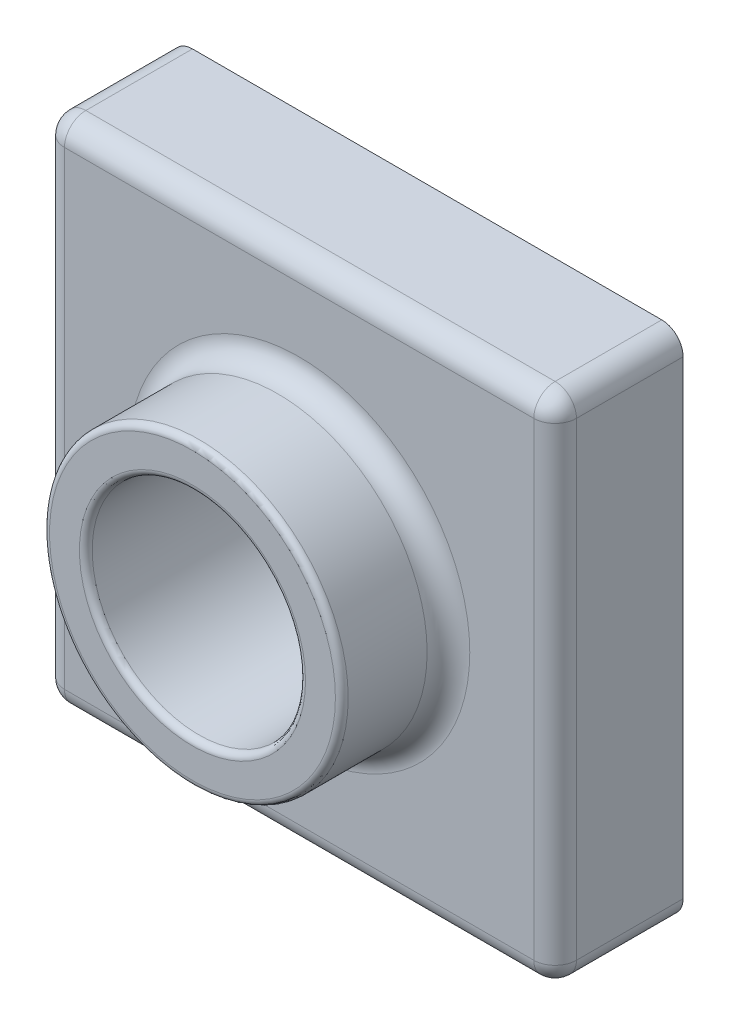
ISO-10303-21;
HEADER;
FILE_DESCRIPTION(('STEP AP214'),'2;1');
FILE_NAME('part.step','',(''),(''),'','','');
FILE_SCHEMA(('AUTOMOTIVE_DESIGN { 1 0 10303 214 1 1 1 1 }'));
ENDSEC;
DATA;
#1=APPLICATION_CONTEXT('core data for automotive mechanical design processes');
#2=APPLICATION_PROTOCOL_DEFINITION('international standard','automotive_design',2000,#1);
#3=PRODUCT_CONTEXT('',#1,'mechanical');
#4=PRODUCT('Part','Part','',(#3));
#5=PRODUCT_RELATED_PRODUCT_CATEGORY('part','',(#4));
#6=PRODUCT_DEFINITION_FORMATION('','',#4);
#7=PRODUCT_DEFINITION_CONTEXT('part definition',#1,'design');
#8=PRODUCT_DEFINITION('design','',#6,#7);
#9=PRODUCT_DEFINITION_SHAPE('','',#8);
#10=(LENGTH_UNIT() NAMED_UNIT(*) SI_UNIT(.MILLI.,.METRE.));
#11=(NAMED_UNIT(*) PLANE_ANGLE_UNIT() SI_UNIT($,.RADIAN.));
#12=(NAMED_UNIT(*) SI_UNIT($,.STERADIAN.) SOLID_ANGLE_UNIT());
#13=UNCERTAINTY_MEASURE_WITH_UNIT(LENGTH_MEASURE(1.E-05),#10,'distance_accuracy_value','');
#14=(GEOMETRIC_REPRESENTATION_CONTEXT(3) GLOBAL_UNCERTAINTY_ASSIGNED_CONTEXT((#13)) GLOBAL_UNIT_ASSIGNED_CONTEXT((#10,
#11,#12)) REPRESENTATION_CONTEXT('',''));
#15=CARTESIAN_POINT('',(0.,0.,0.));
#16=DIRECTION('',(0.,0.,1.));
#17=DIRECTION('',(1.,0.,0.));
#18=AXIS2_PLACEMENT_3D('',#15,#16,#17);
#19=CARTESIAN_POINT('',(0.,0.,0.));
#20=DIRECTION('',(0.,0.,1.));
#21=DIRECTION('',(1.,0.,0.));
#22=AXIS2_PLACEMENT_3D('',#19,#20,#21);
#23=PLANE('',#22);
#24=DIRECTION('',(-1.,0.,0.));
#25=VECTOR('',#24,1.);
#26=CARTESIAN_POINT('',(0.,120.,0.));
#27=LINE('',#26,#25);
#28=CARTESIAN_POINT('',(115.,120.,0.));
#29=VERTEX_POINT('',#28);
#30=CARTESIAN_POINT('',(5.,120.,0.));
#31=VERTEX_POINT('',#30);
#32=EDGE_CURVE('E299',#29,#31,#27,.T.);
#33=ORIENTED_EDGE('',*,*,#32,.F.);
#34=CARTESIAN_POINT('',(115.,115.,0.));
#35=DIRECTION('',(0.,0.,1.));
#36=DIRECTION('',(1.,0.,0.));
#37=AXIS2_PLACEMENT_3D('',#34,#35,#36);
#38=CIRCLE('',#37,5.);
#39=CARTESIAN_POINT('',(120.,115.,0.));
#40=VERTEX_POINT('',#39);
#41=EDGE_CURVE('E369',#29,#40,#38,.F.);
#42=ORIENTED_EDGE('',*,*,#41,.T.);
#43=DIRECTION('',(0.,1.,0.));
#44=VECTOR('',#43,1.);
#45=CARTESIAN_POINT('',(120.,120.,0.));
#46=LINE('',#45,#44);
#47=CARTESIAN_POINT('',(120.,5.,0.));
#48=VERTEX_POINT('',#47);
#49=EDGE_CURVE('E295',#48,#40,#46,.T.);
#50=ORIENTED_EDGE('',*,*,#49,.F.);
#51=CARTESIAN_POINT('',(115.,5.,0.));
#52=DIRECTION('',(0.,0.,1.));
#53=DIRECTION('',(1.,0.,0.));
#54=AXIS2_PLACEMENT_3D('',#51,#52,#53);
#55=CIRCLE('',#54,5.);
#56=CARTESIAN_POINT('',(115.,0.,0.));
#57=VERTEX_POINT('',#56);
#58=EDGE_CURVE('E360',#48,#57,#55,.F.);
#59=ORIENTED_EDGE('',*,*,#58,.T.);
#60=DIRECTION('',(1.,0.,0.));
#61=VECTOR('',#60,1.);
#62=CARTESIAN_POINT('',(0.,0.,0.));
#63=LINE('',#62,#61);
#64=CARTESIAN_POINT('',(5.,0.,0.));
#65=VERTEX_POINT('',#64);
#66=EDGE_CURVE('E291',#65,#57,#63,.T.);
#67=ORIENTED_EDGE('',*,*,#66,.F.);
#68=CARTESIAN_POINT('',(5.,5.,0.));
#69=DIRECTION('',(0.,0.,1.));
#70=DIRECTION('',(1.,0.,0.));
#71=AXIS2_PLACEMENT_3D('',#68,#69,#70);
#72=CIRCLE('',#71,5.);
#73=CARTESIAN_POINT('',(0.,5.,0.));
#74=VERTEX_POINT('',#73);
#75=EDGE_CURVE('E363',#65,#74,#72,.F.);
#76=ORIENTED_EDGE('',*,*,#75,.T.);
#77=DIRECTION('',(0.,-1.,0.));
#78=VECTOR('',#77,1.);
#79=CARTESIAN_POINT('',(0.,120.,0.));
#80=LINE('',#79,#78);
#81=CARTESIAN_POINT('',(0.,115.,0.));
#82=VERTEX_POINT('',#81);
#83=EDGE_CURVE('E286',#82,#74,#80,.T.);
#84=ORIENTED_EDGE('',*,*,#83,.F.);
#85=CARTESIAN_POINT('',(5.,115.,0.));
#86=DIRECTION('',(0.,0.,1.));
#87=DIRECTION('',(1.,0.,0.));
#88=AXIS2_PLACEMENT_3D('',#85,#86,#87);
#89=CIRCLE('',#88,5.);
#90=EDGE_CURVE('E366',#82,#31,#89,.F.);
#91=ORIENTED_EDGE('',*,*,#90,.T.);
#92=EDGE_LOOP('',(#33,#42,#50,#59,#67,#76,#84,#91));
#93=FACE_BOUND('',#92,.T.);
#94=CARTESIAN_POINT('',(115.,115.,0.));
#95=DIRECTION('',(0.,0.,1.));
#96=DIRECTION('',(1.,0.,0.));
#97=AXIS2_PLACEMENT_3D('',#94,#95,#96);
#98=CIRCLE('',#97,3.);
#99=CARTESIAN_POINT('',(115.,118.,0.));
#100=VERTEX_POINT('',#99);
#101=CARTESIAN_POINT('',(118.,115.,0.));
#102=VERTEX_POINT('',#101);
#103=EDGE_CURVE('E247',#100,#102,#98,.F.);
#104=ORIENTED_EDGE('',*,*,#103,.F.);
#105=DIRECTION('',(-1.,0.,0.));
#106=VECTOR('',#105,1.);
#107=CARTESIAN_POINT('',(0.,118.,0.));
#108=LINE('',#107,#106);
#109=CARTESIAN_POINT('',(5.,118.,0.));
#110=VERTEX_POINT('',#109);
#111=EDGE_CURVE('E260',#100,#110,#108,.T.);
#112=ORIENTED_EDGE('',*,*,#111,.T.);
#113=CARTESIAN_POINT('',(5.,115.,0.));
#114=DIRECTION('',(0.,0.,1.));
#115=DIRECTION('',(1.,0.,0.));
#116=AXIS2_PLACEMENT_3D('',#113,#114,#115);
#117=CIRCLE('',#116,3.);
#118=CARTESIAN_POINT('',(2.,115.,0.));
#119=VERTEX_POINT('',#118);
#120=EDGE_CURVE('E256',#119,#110,#117,.F.);
#121=ORIENTED_EDGE('',*,*,#120,.F.);
#122=DIRECTION('',(0.,-1.,0.));
#123=VECTOR('',#122,1.);
#124=CARTESIAN_POINT('',(2.,120.,0.));
#125=LINE('',#124,#123);
#126=CARTESIAN_POINT('',(2.,5.,0.));
#127=VERTEX_POINT('',#126);
#128=EDGE_CURVE('E55',#119,#127,#125,.T.);
#129=ORIENTED_EDGE('',*,*,#128,.T.);
#130=CARTESIAN_POINT('',(5.,5.,0.));
#131=DIRECTION('',(0.,0.,1.));
#132=DIRECTION('',(1.,0.,0.));
#133=AXIS2_PLACEMENT_3D('',#130,#131,#132);
#134=CIRCLE('',#133,3.);
#135=CARTESIAN_POINT('',(5.,2.,0.));
#136=VERTEX_POINT('',#135);
#137=EDGE_CURVE('E259',#136,#127,#134,.F.);
#138=ORIENTED_EDGE('',*,*,#137,.F.);
#139=DIRECTION('',(1.,0.,0.));
#140=VECTOR('',#139,1.);
#141=CARTESIAN_POINT('',(0.,2.,0.));
#142=LINE('',#141,#140);
#143=CARTESIAN_POINT('',(115.,2.,0.));
#144=VERTEX_POINT('',#143);
#145=EDGE_CURVE('E254',#136,#144,#142,.T.);
#146=ORIENTED_EDGE('',*,*,#145,.T.);
#147=CARTESIAN_POINT('',(115.,5.,0.));
#148=DIRECTION('',(0.,0.,1.));
#149=DIRECTION('',(1.,0.,0.));
#150=AXIS2_PLACEMENT_3D('',#147,#148,#149);
#151=CIRCLE('',#150,3.);
#152=CARTESIAN_POINT('',(118.,5.,0.));
#153=VERTEX_POINT('',#152);
#154=EDGE_CURVE('E241',#153,#144,#151,.F.);
#155=ORIENTED_EDGE('',*,*,#154,.F.);
#156=DIRECTION('',(0.,1.,0.));
#157=VECTOR('',#156,1.);
#158=CARTESIAN_POINT('',(118.,120.,0.));
#159=LINE('',#158,#157);
#160=EDGE_CURVE('E265',#153,#102,#159,.T.);
#161=ORIENTED_EDGE('',*,*,#160,.T.);
#162=EDGE_LOOP('',(#104,#112,#121,#129,#138,#146,#155,#161));
#163=FACE_BOUND('',#162,.T.);
#164=ADVANCED_FACE('F39',(#93,#163),#23,.F.);
#165=CARTESIAN_POINT('',(0.,120.,30.));
#166=DIRECTION('',(1.,0.,0.));
#167=DIRECTION('',(0.,0.,-1.));
#168=AXIS2_PLACEMENT_3D('',#165,#166,#167);
#169=PLANE('',#168);
#170=DIRECTION('',(0.,-1.,0.));
#171=VECTOR('',#170,1.);
#172=CARTESIAN_POINT('',(0.,120.,25.));
#173=LINE('',#172,#171);
#174=CARTESIAN_POINT('',(0.,5.,25.));
#175=VERTEX_POINT('',#174);
#176=CARTESIAN_POINT('',(0.,115.,25.));
#177=VERTEX_POINT('',#176);
#178=EDGE_CURVE('E63',#175,#177,#173,.F.);
#179=ORIENTED_EDGE('',*,*,#178,.T.);
#180=DIRECTION('',(0.,0.,-1.));
#181=VECTOR('',#180,1.);
#182=CARTESIAN_POINT('',(0.,115.,30.));
#183=LINE('',#182,#181);
#184=EDGE_CURVE('E353',#177,#82,#183,.T.);
#185=ORIENTED_EDGE('',*,*,#184,.T.);
#186=ORIENTED_EDGE('',*,*,#83,.T.);
#187=DIRECTION('',(0.,0.,-1.));
#188=VECTOR('',#187,1.);
#189=CARTESIAN_POINT('',(0.,5.,30.));
#190=LINE('',#189,#188);
#191=EDGE_CURVE('E348',#74,#175,#190,.F.);
#192=ORIENTED_EDGE('',*,*,#191,.T.);
#193=EDGE_LOOP('',(#179,#185,#186,#192));
#194=FACE_BOUND('',#193,.T.);
#195=ADVANCED_FACE('F469',(#194),#169,.F.);
#196=CARTESIAN_POINT('',(0.,0.,30.));
#197=DIRECTION('',(0.,1.,0.));
#198=DIRECTION('',(0.,0.,1.));
#199=AXIS2_PLACEMENT_3D('',#196,#197,#198);
#200=PLANE('',#199);
#201=DIRECTION('',(1.,0.,0.));
#202=VECTOR('',#201,1.);
#203=CARTESIAN_POINT('',(0.,0.,25.));
#204=LINE('',#203,#202);
#205=CARTESIAN_POINT('',(115.,0.,25.));
#206=VERTEX_POINT('',#205);
#207=CARTESIAN_POINT('',(5.,0.,25.));
#208=VERTEX_POINT('',#207);
#209=EDGE_CURVE('E342',#206,#208,#204,.F.);
#210=ORIENTED_EDGE('',*,*,#209,.T.);
#211=DIRECTION('',(0.,0.,-1.));
#212=VECTOR('',#211,1.);
#213=CARTESIAN_POINT('',(5.,0.,30.));
#214=LINE('',#213,#212);
#215=EDGE_CURVE('E345',#208,#65,#214,.T.);
#216=ORIENTED_EDGE('',*,*,#215,.T.);
#217=ORIENTED_EDGE('',*,*,#66,.T.);
#218=DIRECTION('',(0.,0.,-1.));
#219=VECTOR('',#218,1.);
#220=CARTESIAN_POINT('',(115.,0.,30.));
#221=LINE('',#220,#219);
#222=EDGE_CURVE('E339',#57,#206,#221,.F.);
#223=ORIENTED_EDGE('',*,*,#222,.T.);
#224=EDGE_LOOP('',(#210,#216,#217,#223));
#225=FACE_BOUND('',#224,.T.);
#226=ADVANCED_FACE('F474',(#225),#200,.F.);
#227=CARTESIAN_POINT('',(120.,120.,30.));
#228=DIRECTION('',(-1.,0.,0.));
#229=DIRECTION('',(0.,0.,1.));
#230=AXIS2_PLACEMENT_3D('',#227,#228,#229);
#231=PLANE('',#230);
#232=ORIENTED_EDGE('',*,*,#49,.T.);
#233=DIRECTION('',(0.,0.,-1.));
#234=VECTOR('',#233,1.);
#235=CARTESIAN_POINT('',(120.,115.,30.));
#236=LINE('',#235,#234);
#237=CARTESIAN_POINT('',(120.,115.,25.));
#238=VERTEX_POINT('',#237);
#239=EDGE_CURVE('E336',#40,#238,#236,.F.);
#240=ORIENTED_EDGE('',*,*,#239,.T.);
#241=DIRECTION('',(0.,1.,0.));
#242=VECTOR('',#241,1.);
#243=CARTESIAN_POINT('',(120.,0.,25.));
#244=LINE('',#243,#242);
#245=CARTESIAN_POINT('',(120.,5.,25.));
#246=VERTEX_POINT('',#245);
#247=EDGE_CURVE('E333',#238,#246,#244,.F.);
#248=ORIENTED_EDGE('',*,*,#247,.T.);
#249=DIRECTION('',(0.,0.,-1.));
#250=VECTOR('',#249,1.);
#251=CARTESIAN_POINT('',(120.,5.,30.));
#252=LINE('',#251,#250);
#253=EDGE_CURVE('E330',#246,#48,#252,.T.);
#254=ORIENTED_EDGE('',*,*,#253,.T.);
#255=EDGE_LOOP('',(#232,#240,#248,#254));
#256=FACE_BOUND('',#255,.T.);
#257=ADVANCED_FACE('F904',(#256),#231,.F.);
#258=CARTESIAN_POINT('',(0.,120.,30.));
#259=DIRECTION('',(0.,-1.,0.));
#260=DIRECTION('',(0.,0.,-1.));
#261=AXIS2_PLACEMENT_3D('',#258,#259,#260);
#262=PLANE('',#261);
#263=DIRECTION('',(-1.,0.,0.));
#264=VECTOR('',#263,1.);
#265=CARTESIAN_POINT('',(120.,120.,25.));
#266=LINE('',#265,#264);
#267=CARTESIAN_POINT('',(5.,120.,25.));
#268=VERTEX_POINT('',#267);
#269=CARTESIAN_POINT('',(115.,120.,25.));
#270=VERTEX_POINT('',#269);
#271=EDGE_CURVE('E323',#268,#270,#266,.F.);
#272=ORIENTED_EDGE('',*,*,#271,.T.);
#273=DIRECTION('',(0.,0.,-1.));
#274=VECTOR('',#273,1.);
#275=CARTESIAN_POINT('',(115.,120.,30.));
#276=LINE('',#275,#274);
#277=EDGE_CURVE('E327',#270,#29,#276,.T.);
#278=ORIENTED_EDGE('',*,*,#277,.T.);
#279=ORIENTED_EDGE('',*,*,#32,.T.);
#280=DIRECTION('',(0.,0.,-1.));
#281=VECTOR('',#280,1.);
#282=CARTESIAN_POINT('',(5.,120.,30.));
#283=LINE('',#282,#281);
#284=EDGE_CURVE('E320',#31,#268,#283,.F.);
#285=ORIENTED_EDGE('',*,*,#284,.T.);
#286=EDGE_LOOP('',(#272,#278,#279,#285));
#287=FACE_BOUND('',#286,.T.);
#288=ADVANCED_FACE('F463',(#287),#262,.F.);
#289=CARTESIAN_POINT('',(0.,0.,30.));
#290=DIRECTION('',(0.,0.,1.));
#291=DIRECTION('',(1.,0.,0.));
#292=AXIS2_PLACEMENT_3D('',#289,#290,#291);
#293=PLANE('',#292);
#294=DIRECTION('',(0.,1.,0.));
#295=VECTOR('',#294,1.);
#296=CARTESIAN_POINT('',(115.,120.,30.));
#297=LINE('',#296,#295);
#298=CARTESIAN_POINT('',(115.,5.,30.));
#299=VERTEX_POINT('',#298);
#300=CARTESIAN_POINT('',(115.,115.,30.));
#301=VERTEX_POINT('',#300);
#302=EDGE_CURVE('E313',#299,#301,#297,.T.);
#303=ORIENTED_EDGE('',*,*,#302,.T.);
#304=DIRECTION('',(-1.,0.,0.));
#305=VECTOR('',#304,1.);
#306=CARTESIAN_POINT('',(0.,115.,30.));
#307=LINE('',#306,#305);
#308=CARTESIAN_POINT('',(5.,115.,30.));
#309=VERTEX_POINT('',#308);
#310=EDGE_CURVE('E316',#301,#309,#307,.T.);
#311=ORIENTED_EDGE('',*,*,#310,.T.);
#312=DIRECTION('',(0.,-1.,0.));
#313=VECTOR('',#312,1.);
#314=CARTESIAN_POINT('',(5.,0.,30.));
#315=LINE('',#314,#313);
#316=CARTESIAN_POINT('',(5.,5.,30.));
#317=VERTEX_POINT('',#316);
#318=EDGE_CURVE('E307',#309,#317,#315,.T.);
#319=ORIENTED_EDGE('',*,*,#318,.T.);
#320=DIRECTION('',(1.,0.,0.));
#321=VECTOR('',#320,1.);
#322=CARTESIAN_POINT('',(120.,5.,30.));
#323=LINE('',#322,#321);
#324=EDGE_CURVE('E310',#317,#299,#323,.T.);
#325=ORIENTED_EDGE('',*,*,#324,.T.);
#326=EDGE_LOOP('',(#303,#311,#319,#325));
#327=FACE_BOUND('',#326,.T.);
#328=CARTESIAN_POINT('',(60.,60.,30.));
#329=DIRECTION('',(0.,0.,1.));
#330=DIRECTION('',(1.,0.,0.));
#331=AXIS2_PLACEMENT_3D('',#328,#329,#330);
#332=CIRCLE('',#331,40.);
#333=CARTESIAN_POINT('',(100.,60.,30.));
#334=VERTEX_POINT('',#333);
#335=EDGE_CURVE('E303',#334,#334,#332,.F.);
#336=ORIENTED_EDGE('',*,*,#335,.T.);
#337=EDGE_LOOP('',(#336));
#338=FACE_BOUND('',#337,.T.);
#339=ADVANCED_FACE('F455',(#327,#338),#293,.T.);
#340=CARTESIAN_POINT('',(60.,60.,0.));
#341=DIRECTION('',(0.,0.,1.));
#342=DIRECTION('',(1.,0.,0.));
#343=AXIS2_PLACEMENT_3D('',#340,#341,#342);
#344=CIRCLE('',#343,27.);
#345=CARTESIAN_POINT('',(87.,60.,0.));
#346=VERTEX_POINT('',#345);
#347=EDGE_CURVE('E255',#346,#346,#344,.T.);
#348=ORIENTED_EDGE('',*,*,#347,.F.);
#349=EDGE_LOOP('',(#348));
#350=FACE_BOUND('',#349,.T.);
#351=CARTESIAN_POINT('',(60.,60.,0.));
#352=DIRECTION('',(0.,0.,1.));
#353=DIRECTION('',(1.,0.,0.));
#354=AXIS2_PLACEMENT_3D('',#351,#352,#353);
#355=CIRCLE('',#354,25.);
#356=CARTESIAN_POINT('',(85.,60.,0.));
#357=VERTEX_POINT('',#356);
#358=EDGE_CURVE('E282',#357,#357,#355,.T.);
#359=ORIENTED_EDGE('',*,*,#358,.T.);
#360=EDGE_LOOP('',(#359));
#361=FACE_BOUND('',#360,.T.);
#362=ADVANCED_FACE('F453',(#350,#361),#23,.F.);
#363=CARTESIAN_POINT('',(60.,60.,55.));
#364=DIRECTION('',(0.,0.,-1.));
#365=DIRECTION('',(-1.,0.,0.));
#366=AXIS2_PLACEMENT_3D('',#363,#364,#365);
#367=CYLINDRICAL_SURFACE('',#366,35.);
#368=CARTESIAN_POINT('',(60.,60.,53.5));
#369=DIRECTION('',(0.,0.,1.));
#370=DIRECTION('',(1.,0.,0.));
#371=AXIS2_PLACEMENT_3D('',#368,#369,#370);
#372=CIRCLE('',#371,35.);
#373=CARTESIAN_POINT('',(95.,60.,53.5));
#374=VERTEX_POINT('',#373);
#375=EDGE_CURVE('E48',#374,#374,#372,.F.);
#376=ORIENTED_EDGE('',*,*,#375,.T.);
#377=EDGE_LOOP('',(#376));
#378=FACE_BOUND('',#377,.T.);
#379=CARTESIAN_POINT('',(60.,60.,35.));
#380=DIRECTION('',(0.,0.,1.));
#381=DIRECTION('',(1.,0.,0.));
#382=AXIS2_PLACEMENT_3D('',#379,#380,#381);
#383=CIRCLE('',#382,35.);
#384=CARTESIAN_POINT('',(95.,60.,35.));
#385=VERTEX_POINT('',#384);
#386=EDGE_CURVE('E356',#385,#385,#383,.T.);
#387=ORIENTED_EDGE('',*,*,#386,.T.);
#388=EDGE_LOOP('',(#387));
#389=FACE_BOUND('',#388,.T.);
#390=ADVANCED_FACE('F427',(#378,#389),#367,.T.);
#391=CARTESIAN_POINT('',(60.,60.,55.));
#392=DIRECTION('',(0.,0.,1.));
#393=DIRECTION('',(1.,0.,0.));
#394=AXIS2_PLACEMENT_3D('',#391,#392,#393);
#395=PLANE('',#394);
#396=CARTESIAN_POINT('',(60.,60.,55.));
#397=DIRECTION('',(0.,0.,1.));
#398=DIRECTION('',(1.,0.,0.));
#399=AXIS2_PLACEMENT_3D('',#396,#397,#398);
#400=CIRCLE('',#399,33.5);
#401=CARTESIAN_POINT('',(93.5,60.,55.));
#402=VERTEX_POINT('',#401);
#403=EDGE_CURVE('E420',#402,#402,#400,.T.);
#404=ORIENTED_EDGE('',*,*,#403,.T.);
#405=EDGE_LOOP('',(#404));
#406=FACE_BOUND('',#405,.T.);
#407=CARTESIAN_POINT('',(60.,60.,55.));
#408=DIRECTION('',(0.,0.,1.));
#409=DIRECTION('',(1.,0.,0.));
#410=AXIS2_PLACEMENT_3D('',#407,#408,#409);
#411=CIRCLE('',#410,26.5);
#412=CARTESIAN_POINT('',(86.5,60.,55.));
#413=VERTEX_POINT('',#412);
#414=EDGE_CURVE('E372',#413,#413,#411,.F.);
#415=ORIENTED_EDGE('',*,*,#414,.T.);
#416=EDGE_LOOP('',(#415));
#417=FACE_BOUND('',#416,.T.);
#418=ADVANCED_FACE('F436',(#406,#417),#395,.T.);
#419=CARTESIAN_POINT('',(60.,60.,0.));
#420=DIRECTION('',(0.,0.,1.));
#421=DIRECTION('',(1.,0.,0.));
#422=AXIS2_PLACEMENT_3D('',#419,#420,#421);
#423=CYLINDRICAL_SURFACE('',#422,25.);
#424=CARTESIAN_POINT('',(60.,60.,53.5));
#425=DIRECTION('',(0.,0.,1.));
#426=DIRECTION('',(1.,0.,0.));
#427=AXIS2_PLACEMENT_3D('',#424,#425,#426);
#428=CIRCLE('',#427,25.);
#429=CARTESIAN_POINT('',(85.,60.,53.5));
#430=VERTEX_POINT('',#429);
#431=EDGE_CURVE('E11',#430,#430,#428,.T.);
#432=ORIENTED_EDGE('',*,*,#431,.T.);
#433=EDGE_LOOP('',(#432));
#434=FACE_BOUND('',#433,.T.);
#435=ORIENTED_EDGE('',*,*,#358,.F.);
#436=EDGE_LOOP('',(#435));
#437=FACE_BOUND('',#436,.T.);
#438=ADVANCED_FACE('F439',(#434,#437),#423,.F.);
#439=CARTESIAN_POINT('',(115.,5.,30.));
#440=DIRECTION('',(0.,0.,-1.));
#441=DIRECTION('',(-1.,0.,0.));
#442=AXIS2_PLACEMENT_3D('',#439,#440,#441);
#443=CYLINDRICAL_SURFACE('',#442,5.);
#444=ORIENTED_EDGE('',*,*,#58,.F.);
#445=ORIENTED_EDGE('',*,*,#253,.F.);
#446=CARTESIAN_POINT('',(115.,5.,25.));
#447=DIRECTION('',(0.,0.,1.));
#448=DIRECTION('',(1.,0.,0.));
#449=AXIS2_PLACEMENT_3D('',#446,#447,#448);
#450=CIRCLE('',#449,5.);
#451=EDGE_CURVE('E287',#206,#246,#450,.T.);
#452=ORIENTED_EDGE('',*,*,#451,.F.);
#453=ORIENTED_EDGE('',*,*,#222,.F.);
#454=EDGE_LOOP('',(#444,#445,#452,#453));
#455=FACE_BOUND('',#454,.T.);
#456=ADVANCED_FACE('F449',(#455),#443,.T.);
#457=CARTESIAN_POINT('',(0.,5.,25.));
#458=DIRECTION('',(-1.,0.,0.));
#459=DIRECTION('',(0.,0.,1.));
#460=AXIS2_PLACEMENT_3D('',#457,#458,#459);
#461=CYLINDRICAL_SURFACE('',#460,5.);
#462=CARTESIAN_POINT('',(5.,5.,25.));
#463=DIRECTION('',(-1.,0.,0.));
#464=DIRECTION('',(0.,0.,1.));
#465=AXIS2_PLACEMENT_3D('',#462,#463,#464);
#466=CIRCLE('',#465,5.);
#467=EDGE_CURVE('E406',#208,#317,#466,.T.);
#468=ORIENTED_EDGE('',*,*,#467,.F.);
#469=ORIENTED_EDGE('',*,*,#209,.F.);
#470=CARTESIAN_POINT('',(115.,5.,25.));
#471=DIRECTION('',(1.,0.,0.));
#472=DIRECTION('',(0.,0.,-1.));
#473=AXIS2_PLACEMENT_3D('',#470,#471,#472);
#474=CIRCLE('',#473,5.);
#475=EDGE_CURVE('E410',#299,#206,#474,.T.);
#476=ORIENTED_EDGE('',*,*,#475,.F.);
#477=ORIENTED_EDGE('',*,*,#324,.F.);
#478=EDGE_LOOP('',(#468,#469,#476,#477));
#479=FACE_BOUND('',#478,.T.);
#480=ADVANCED_FACE('F873',(#479),#461,.T.);
#481=CARTESIAN_POINT('',(5.,5.,30.));
#482=DIRECTION('',(0.,0.,-1.));
#483=DIRECTION('',(-1.,0.,0.));
#484=AXIS2_PLACEMENT_3D('',#481,#482,#483);
#485=CYLINDRICAL_SURFACE('',#484,5.);
#486=ORIENTED_EDGE('',*,*,#75,.F.);
#487=ORIENTED_EDGE('',*,*,#215,.F.);
#488=CARTESIAN_POINT('',(5.,5.,25.));
#489=DIRECTION('',(0.,0.,1.));
#490=DIRECTION('',(1.,0.,0.));
#491=AXIS2_PLACEMENT_3D('',#488,#489,#490);
#492=CIRCLE('',#491,5.);
#493=EDGE_CURVE('E402',#175,#208,#492,.T.);
#494=ORIENTED_EDGE('',*,*,#493,.F.);
#495=ORIENTED_EDGE('',*,*,#191,.F.);
#496=EDGE_LOOP('',(#486,#487,#494,#495));
#497=FACE_BOUND('',#496,.T.);
#498=ADVANCED_FACE('F863',(#497),#485,.T.);
#499=CARTESIAN_POINT('',(115.,5.,25.));
#500=DIRECTION('',(0.,0.,1.));
#501=DIRECTION('',(1.,0.,0.));
#502=AXIS2_PLACEMENT_3D('',#499,#500,#501);
#503=SPHERICAL_SURFACE('',#502,5.);
#504=ORIENTED_EDGE('',*,*,#475,.T.);
#505=ORIENTED_EDGE('',*,*,#451,.T.);
#506=CARTESIAN_POINT('',(115.,5.,25.));
#507=DIRECTION('',(0.,-1.,0.));
#508=DIRECTION('',(0.,0.,-1.));
#509=AXIS2_PLACEMENT_3D('',#506,#507,#508);
#510=CIRCLE('',#509,5.);
#511=EDGE_CURVE('E398',#299,#246,#510,.F.);
#512=ORIENTED_EDGE('',*,*,#511,.F.);
#513=EDGE_LOOP('',(#504,#505,#512));
#514=FACE_BOUND('',#513,.T.);
#515=ADVANCED_FACE('F853',(#514),#503,.T.);
#516=CARTESIAN_POINT('',(5.,5.,25.));
#517=DIRECTION('',(0.,0.,1.));
#518=DIRECTION('',(1.,0.,0.));
#519=AXIS2_PLACEMENT_3D('',#516,#517,#518);
#520=SPHERICAL_SURFACE('',#519,5.);
#521=ORIENTED_EDGE('',*,*,#493,.T.);
#522=ORIENTED_EDGE('',*,*,#467,.T.);
#523=CARTESIAN_POINT('',(5.,5.,25.));
#524=DIRECTION('',(0.,-1.,0.));
#525=DIRECTION('',(0.,0.,-1.));
#526=AXIS2_PLACEMENT_3D('',#523,#524,#525);
#527=CIRCLE('',#526,5.);
#528=EDGE_CURVE('E394',#175,#317,#527,.F.);
#529=ORIENTED_EDGE('',*,*,#528,.F.);
#530=EDGE_LOOP('',(#521,#522,#529));
#531=FACE_BOUND('',#530,.T.);
#532=ADVANCED_FACE('F843',(#531),#520,.T.);
#533=CARTESIAN_POINT('',(115.,115.,30.));
#534=DIRECTION('',(0.,0.,-1.));
#535=DIRECTION('',(-1.,0.,0.));
#536=AXIS2_PLACEMENT_3D('',#533,#534,#535);
#537=CYLINDRICAL_SURFACE('',#536,5.);
#538=ORIENTED_EDGE('',*,*,#41,.F.);
#539=ORIENTED_EDGE('',*,*,#277,.F.);
#540=CARTESIAN_POINT('',(115.,115.,25.));
#541=DIRECTION('',(0.,0.,1.));
#542=DIRECTION('',(1.,0.,0.));
#543=AXIS2_PLACEMENT_3D('',#540,#541,#542);
#544=CIRCLE('',#543,5.);
#545=EDGE_CURVE('E390',#238,#270,#544,.T.);
#546=ORIENTED_EDGE('',*,*,#545,.F.);
#547=ORIENTED_EDGE('',*,*,#239,.F.);
#548=EDGE_LOOP('',(#538,#539,#546,#547));
#549=FACE_BOUND('',#548,.T.);
#550=ADVANCED_FACE('F833',(#549),#537,.T.);
#551=CARTESIAN_POINT('',(115.,0.,25.));
#552=DIRECTION('',(0.,-1.,0.));
#553=DIRECTION('',(0.,0.,-1.));
#554=AXIS2_PLACEMENT_3D('',#551,#552,#553);
#555=CYLINDRICAL_SURFACE('',#554,5.);
#556=ORIENTED_EDGE('',*,*,#511,.T.);
#557=ORIENTED_EDGE('',*,*,#247,.F.);
#558=CARTESIAN_POINT('',(115.,115.,25.));
#559=DIRECTION('',(0.,1.,0.));
#560=DIRECTION('',(0.,0.,1.));
#561=AXIS2_PLACEMENT_3D('',#558,#559,#560);
#562=CIRCLE('',#561,5.);
#563=EDGE_CURVE('E386',#301,#238,#562,.T.);
#564=ORIENTED_EDGE('',*,*,#563,.F.);
#565=ORIENTED_EDGE('',*,*,#302,.F.);
#566=EDGE_LOOP('',(#556,#557,#564,#565));
#567=FACE_BOUND('',#566,.T.);
#568=ADVANCED_FACE('F823',(#567),#555,.T.);
#569=CARTESIAN_POINT('',(5.,0.,25.));
#570=DIRECTION('',(0.,1.,0.));
#571=DIRECTION('',(0.,0.,1.));
#572=AXIS2_PLACEMENT_3D('',#569,#570,#571);
#573=CYLINDRICAL_SURFACE('',#572,5.);
#574=ORIENTED_EDGE('',*,*,#528,.T.);
#575=ORIENTED_EDGE('',*,*,#318,.F.);
#576=CARTESIAN_POINT('',(5.,115.,25.));
#577=DIRECTION('',(0.,1.,0.));
#578=DIRECTION('',(0.,0.,1.));
#579=AXIS2_PLACEMENT_3D('',#576,#577,#578);
#580=CIRCLE('',#579,5.);
#581=EDGE_CURVE('E382',#177,#309,#580,.T.);
#582=ORIENTED_EDGE('',*,*,#581,.F.);
#583=ORIENTED_EDGE('',*,*,#178,.F.);
#584=EDGE_LOOP('',(#574,#575,#582,#583));
#585=FACE_BOUND('',#584,.T.);
#586=ADVANCED_FACE('F813',(#585),#573,.T.);
#587=CARTESIAN_POINT('',(5.,115.,30.));
#588=DIRECTION('',(0.,0.,-1.));
#589=DIRECTION('',(-1.,0.,0.));
#590=AXIS2_PLACEMENT_3D('',#587,#588,#589);
#591=CYLINDRICAL_SURFACE('',#590,5.);
#592=ORIENTED_EDGE('',*,*,#90,.F.);
#593=ORIENTED_EDGE('',*,*,#184,.F.);
#594=CARTESIAN_POINT('',(5.,115.,25.));
#595=DIRECTION('',(0.,0.,1.));
#596=DIRECTION('',(1.,0.,0.));
#597=AXIS2_PLACEMENT_3D('',#594,#595,#596);
#598=CIRCLE('',#597,5.);
#599=EDGE_CURVE('E378',#268,#177,#598,.T.);
#600=ORIENTED_EDGE('',*,*,#599,.F.);
#601=ORIENTED_EDGE('',*,*,#284,.F.);
#602=EDGE_LOOP('',(#592,#593,#600,#601));
#603=FACE_BOUND('',#602,.T.);
#604=ADVANCED_FACE('F803',(#603),#591,.T.);
#605=CARTESIAN_POINT('',(115.,115.,25.));
#606=DIRECTION('',(0.,0.,1.));
#607=DIRECTION('',(1.,0.,0.));
#608=AXIS2_PLACEMENT_3D('',#605,#606,#607);
#609=SPHERICAL_SURFACE('',#608,5.);
#610=ORIENTED_EDGE('',*,*,#563,.T.);
#611=ORIENTED_EDGE('',*,*,#545,.T.);
#612=CARTESIAN_POINT('',(115.,115.,25.));
#613=DIRECTION('',(1.,0.,0.));
#614=DIRECTION('',(0.,0.,-1.));
#615=AXIS2_PLACEMENT_3D('',#612,#613,#614);
#616=CIRCLE('',#615,5.);
#617=EDGE_CURVE('E375',#301,#270,#616,.F.);
#618=ORIENTED_EDGE('',*,*,#617,.F.);
#619=EDGE_LOOP('',(#610,#611,#618));
#620=FACE_BOUND('',#619,.T.);
#621=ADVANCED_FACE('F793',(#620),#609,.T.);
#622=CARTESIAN_POINT('',(5.,115.,25.));
#623=DIRECTION('',(0.,0.,1.));
#624=DIRECTION('',(1.,0.,0.));
#625=AXIS2_PLACEMENT_3D('',#622,#623,#624);
#626=SPHERICAL_SURFACE('',#625,5.);
#627=ORIENTED_EDGE('',*,*,#599,.T.);
#628=ORIENTED_EDGE('',*,*,#581,.T.);
#629=CARTESIAN_POINT('',(5.,115.,25.));
#630=DIRECTION('',(-1.,0.,0.));
#631=DIRECTION('',(0.,0.,1.));
#632=AXIS2_PLACEMENT_3D('',#629,#630,#631);
#633=CIRCLE('',#632,5.);
#634=EDGE_CURVE('E251',#268,#309,#633,.F.);
#635=ORIENTED_EDGE('',*,*,#634,.F.);
#636=EDGE_LOOP('',(#627,#628,#635));
#637=FACE_BOUND('',#636,.T.);
#638=ADVANCED_FACE('F783',(#637),#626,.T.);
#639=CARTESIAN_POINT('',(0.,115.,25.));
#640=DIRECTION('',(1.,0.,0.));
#641=DIRECTION('',(0.,0.,-1.));
#642=AXIS2_PLACEMENT_3D('',#639,#640,#641);
#643=CYLINDRICAL_SURFACE('',#642,5.);
#644=ORIENTED_EDGE('',*,*,#617,.T.);
#645=ORIENTED_EDGE('',*,*,#271,.F.);
#646=ORIENTED_EDGE('',*,*,#634,.T.);
#647=ORIENTED_EDGE('',*,*,#310,.F.);
#648=EDGE_LOOP('',(#644,#645,#646,#647));
#649=FACE_BOUND('',#648,.T.);
#650=ADVANCED_FACE('F773',(#649),#643,.T.);
#651=CARTESIAN_POINT('',(60.,60.,35.));
#652=DIRECTION('',(0.,0.,1.));
#653=DIRECTION('',(1.,0.,0.));
#654=AXIS2_PLACEMENT_3D('',#651,#652,#653);
#655=TOROIDAL_SURFACE('',#654,40.,5.);
#656=ORIENTED_EDGE('',*,*,#335,.F.);
#657=EDGE_LOOP('',(#656));
#658=FACE_BOUND('',#657,.T.);
#659=ORIENTED_EDGE('',*,*,#386,.F.);
#660=EDGE_LOOP('',(#659));
#661=FACE_BOUND('',#660,.T.);
#662=ADVANCED_FACE('F433',(#658,#661),#655,.F.);
#663=CARTESIAN_POINT('',(60.,60.,53.5));
#664=DIRECTION('',(0.,0.,1.));
#665=DIRECTION('',(1.,0.,0.));
#666=AXIS2_PLACEMENT_3D('',#663,#664,#665);
#667=TOROIDAL_SURFACE('',#666,33.5,1.5);
#668=ORIENTED_EDGE('',*,*,#375,.F.);
#669=EDGE_LOOP('',(#668));
#670=FACE_BOUND('',#669,.T.);
#671=ORIENTED_EDGE('',*,*,#403,.F.);
#672=EDGE_LOOP('',(#671));
#673=FACE_BOUND('',#672,.T.);
#674=ADVANCED_FACE('F430',(#670,#673),#667,.T.);
#675=CARTESIAN_POINT('',(60.,60.,53.5));
#676=DIRECTION('',(0.,0.,1.));
#677=DIRECTION('',(1.,0.,0.));
#678=AXIS2_PLACEMENT_3D('',#675,#676,#677);
#679=TOROIDAL_SURFACE('',#678,26.5,1.5);
#680=ORIENTED_EDGE('',*,*,#414,.F.);
#681=EDGE_LOOP('',(#680));
#682=FACE_BOUND('',#681,.T.);
#683=ORIENTED_EDGE('',*,*,#431,.F.);
#684=EDGE_LOOP('',(#683));
#685=FACE_BOUND('',#684,.T.);
#686=ADVANCED_FACE('F41',(#682,#685),#679,.T.);
#687=CARTESIAN_POINT('',(2.,120.,30.));
#688=DIRECTION('',(1.,0.,0.));
#689=DIRECTION('',(0.,0.,-1.));
#690=AXIS2_PLACEMENT_3D('',#687,#688,#689);
#691=PLANE('',#690);
#692=DIRECTION('',(0.,1.,0.));
#693=VECTOR('',#692,1.);
#694=CARTESIAN_POINT('',(2.,120.,25.));
#695=LINE('',#694,#693);
#696=CARTESIAN_POINT('',(2.,5.,25.));
#697=VERTEX_POINT('',#696);
#698=CARTESIAN_POINT('',(2.,115.,25.));
#699=VERTEX_POINT('',#698);
#700=EDGE_CURVE('E180',#697,#699,#695,.T.);
#701=ORIENTED_EDGE('',*,*,#700,.F.);
#702=DIRECTION('',(0.,0.,-1.));
#703=VECTOR('',#702,1.);
#704=CARTESIAN_POINT('',(2.,5.,30.));
#705=LINE('',#704,#703);
#706=EDGE_CURVE('E189',#127,#697,#705,.F.);
#707=ORIENTED_EDGE('',*,*,#706,.F.);
#708=ORIENTED_EDGE('',*,*,#128,.F.);
#709=DIRECTION('',(0.,0.,-1.));
#710=VECTOR('',#709,1.);
#711=CARTESIAN_POINT('',(2.,115.,30.));
#712=LINE('',#711,#710);
#713=EDGE_CURVE('E188',#699,#119,#712,.T.);
#714=ORIENTED_EDGE('',*,*,#713,.F.);
#715=EDGE_LOOP('',(#701,#707,#708,#714));
#716=FACE_BOUND('',#715,.T.);
#717=ADVANCED_FACE('F191',(#716),#691,.T.);
#718=CARTESIAN_POINT('',(0.,2.,30.));
#719=DIRECTION('',(0.,1.,0.));
#720=DIRECTION('',(0.,0.,1.));
#721=AXIS2_PLACEMENT_3D('',#718,#719,#720);
#722=PLANE('',#721);
#723=DIRECTION('',(1.,0.,0.));
#724=VECTOR('',#723,1.);
#725=CARTESIAN_POINT('',(0.,2.,25.));
#726=LINE('',#725,#724);
#727=CARTESIAN_POINT('',(115.,2.,25.));
#728=VERTEX_POINT('',#727);
#729=CARTESIAN_POINT('',(5.,2.,25.));
#730=VERTEX_POINT('',#729);
#731=EDGE_CURVE('E499',#728,#730,#726,.F.);
#732=ORIENTED_EDGE('',*,*,#731,.F.);
#733=DIRECTION('',(0.,0.,1.));
#734=VECTOR('',#733,1.);
#735=CARTESIAN_POINT('',(115.,2.,30.));
#736=LINE('',#735,#734);
#737=EDGE_CURVE('E495',#144,#728,#736,.T.);
#738=ORIENTED_EDGE('',*,*,#737,.F.);
#739=ORIENTED_EDGE('',*,*,#145,.F.);
#740=DIRECTION('',(0.,0.,1.));
#741=VECTOR('',#740,1.);
#742=CARTESIAN_POINT('',(5.,2.,30.));
#743=LINE('',#742,#741);
#744=EDGE_CURVE('E543',#730,#136,#743,.F.);
#745=ORIENTED_EDGE('',*,*,#744,.F.);
#746=EDGE_LOOP('',(#732,#738,#739,#745));
#747=FACE_BOUND('',#746,.T.);
#748=ADVANCED_FACE('F582',(#747),#722,.T.);
#749=CARTESIAN_POINT('',(118.,120.,30.));
#750=DIRECTION('',(-1.,0.,0.));
#751=DIRECTION('',(0.,0.,1.));
#752=AXIS2_PLACEMENT_3D('',#749,#750,#751);
#753=PLANE('',#752);
#754=ORIENTED_EDGE('',*,*,#160,.F.);
#755=DIRECTION('',(0.,0.,1.));
#756=VECTOR('',#755,1.);
#757=CARTESIAN_POINT('',(118.,5.,30.));
#758=LINE('',#757,#756);
#759=CARTESIAN_POINT('',(118.,5.,25.));
#760=VERTEX_POINT('',#759);
#761=EDGE_CURVE('E228',#760,#153,#758,.F.);
#762=ORIENTED_EDGE('',*,*,#761,.F.);
#763=DIRECTION('',(0.,1.,0.));
#764=VECTOR('',#763,1.);
#765=CARTESIAN_POINT('',(118.,120.,25.));
#766=LINE('',#765,#764);
#767=CARTESIAN_POINT('',(118.,115.,25.));
#768=VERTEX_POINT('',#767);
#769=EDGE_CURVE('E492',#768,#760,#766,.F.);
#770=ORIENTED_EDGE('',*,*,#769,.F.);
#771=DIRECTION('',(0.,0.,1.));
#772=VECTOR('',#771,1.);
#773=CARTESIAN_POINT('',(118.,115.,30.));
#774=LINE('',#773,#772);
#775=EDGE_CURVE('E486',#102,#768,#774,.T.);
#776=ORIENTED_EDGE('',*,*,#775,.F.);
#777=EDGE_LOOP('',(#754,#762,#770,#776));
#778=FACE_BOUND('',#777,.T.);
#779=ADVANCED_FACE('F490',(#778),#753,.T.);
#780=CARTESIAN_POINT('',(0.,118.,30.));
#781=DIRECTION('',(0.,-1.,0.));
#782=DIRECTION('',(0.,0.,-1.));
#783=AXIS2_PLACEMENT_3D('',#780,#781,#782);
#784=PLANE('',#783);
#785=DIRECTION('',(1.,0.,0.));
#786=VECTOR('',#785,1.);
#787=CARTESIAN_POINT('',(0.,118.,25.));
#788=LINE('',#787,#786);
#789=CARTESIAN_POINT('',(5.,118.,25.));
#790=VERTEX_POINT('',#789);
#791=CARTESIAN_POINT('',(115.,118.,25.));
#792=VERTEX_POINT('',#791);
#793=EDGE_CURVE('E220',#790,#792,#788,.T.);
#794=ORIENTED_EDGE('',*,*,#793,.F.);
#795=DIRECTION('',(0.,0.,-1.));
#796=VECTOR('',#795,1.);
#797=CARTESIAN_POINT('',(5.,118.,30.));
#798=LINE('',#797,#796);
#799=EDGE_CURVE('E210',#110,#790,#798,.F.);
#800=ORIENTED_EDGE('',*,*,#799,.F.);
#801=ORIENTED_EDGE('',*,*,#111,.F.);
#802=DIRECTION('',(0.,0.,-1.));
#803=VECTOR('',#802,1.);
#804=CARTESIAN_POINT('',(115.,118.,30.));
#805=LINE('',#804,#803);
#806=EDGE_CURVE('E225',#792,#100,#805,.T.);
#807=ORIENTED_EDGE('',*,*,#806,.F.);
#808=EDGE_LOOP('',(#794,#800,#801,#807));
#809=FACE_BOUND('',#808,.T.);
#810=ADVANCED_FACE('F573',(#809),#784,.T.);
#811=CARTESIAN_POINT('',(0.,0.,28.));
#812=DIRECTION('',(0.,0.,1.));
#813=DIRECTION('',(1.,0.,0.));
#814=AXIS2_PLACEMENT_3D('',#811,#812,#813);
#815=PLANE('',#814);
#816=DIRECTION('',(0.,1.,0.));
#817=VECTOR('',#816,1.);
#818=CARTESIAN_POINT('',(115.,0.,28.));
#819=LINE('',#818,#817);
#820=CARTESIAN_POINT('',(115.,5.,28.));
#821=VERTEX_POINT('',#820);
#822=CARTESIAN_POINT('',(115.,115.,28.));
#823=VERTEX_POINT('',#822);
#824=EDGE_CURVE('E515',#821,#823,#819,.T.);
#825=ORIENTED_EDGE('',*,*,#824,.F.);
#826=DIRECTION('',(1.,0.,0.));
#827=VECTOR('',#826,1.);
#828=CARTESIAN_POINT('',(0.,5.,28.));
#829=LINE('',#828,#827);
#830=CARTESIAN_POINT('',(5.,5.,28.));
#831=VERTEX_POINT('',#830);
#832=EDGE_CURVE('E518',#831,#821,#829,.T.);
#833=ORIENTED_EDGE('',*,*,#832,.F.);
#834=DIRECTION('',(0.,1.,0.));
#835=VECTOR('',#834,1.);
#836=CARTESIAN_POINT('',(5.,0.,28.));
#837=LINE('',#836,#835);
#838=CARTESIAN_POINT('',(5.,115.,28.));
#839=VERTEX_POINT('',#838);
#840=EDGE_CURVE('E522',#839,#831,#837,.F.);
#841=ORIENTED_EDGE('',*,*,#840,.F.);
#842=DIRECTION('',(1.,0.,0.));
#843=VECTOR('',#842,1.);
#844=CARTESIAN_POINT('',(0.,115.,28.));
#845=LINE('',#844,#843);
#846=EDGE_CURVE('E221',#823,#839,#845,.F.);
#847=ORIENTED_EDGE('',*,*,#846,.F.);
#848=EDGE_LOOP('',(#825,#833,#841,#847));
#849=FACE_BOUND('',#848,.T.);
#850=CARTESIAN_POINT('',(60.,60.,28.));
#851=DIRECTION('',(0.,0.,1.));
#852=DIRECTION('',(1.,0.,0.));
#853=AXIS2_PLACEMENT_3D('',#850,#851,#852);
#854=CIRCLE('',#853,40.);
#855=CARTESIAN_POINT('',(100.,60.,28.));
#856=VERTEX_POINT('',#855);
#857=EDGE_CURVE('E264',#856,#856,#854,.F.);
#858=ORIENTED_EDGE('',*,*,#857,.F.);
#859=EDGE_LOOP('',(#858));
#860=FACE_BOUND('',#859,.T.);
#861=ADVANCED_FACE('F565',(#849,#860),#815,.F.);
#862=CARTESIAN_POINT('',(60.,60.,55.));
#863=DIRECTION('',(0.,0.,-1.));
#864=DIRECTION('',(-1.,0.,0.));
#865=AXIS2_PLACEMENT_3D('',#862,#863,#864);
#866=CYLINDRICAL_SURFACE('',#865,33.);
#867=CARTESIAN_POINT('',(60.,60.,53.));
#868=DIRECTION('',(0.,0.,1.));
#869=DIRECTION('',(1.,0.,0.));
#870=AXIS2_PLACEMENT_3D('',#867,#868,#869);
#871=CIRCLE('',#870,33.);
#872=CARTESIAN_POINT('',(93.,60.,53.));
#873=VERTEX_POINT('',#872);
#874=EDGE_CURVE('E242',#873,#873,#871,.T.);
#875=ORIENTED_EDGE('',*,*,#874,.T.);
#876=EDGE_LOOP('',(#875));
#877=FACE_BOUND('',#876,.T.);
#878=CARTESIAN_POINT('',(60.,60.,35.));
#879=DIRECTION('',(0.,0.,-1.));
#880=DIRECTION('',(-1.,0.,0.));
#881=AXIS2_PLACEMENT_3D('',#878,#879,#880);
#882=CIRCLE('',#881,33.);
#883=CARTESIAN_POINT('',(27.,60.,35.));
#884=VERTEX_POINT('',#883);
#885=EDGE_CURVE('E196',#884,#884,#882,.F.);
#886=ORIENTED_EDGE('',*,*,#885,.F.);
#887=EDGE_LOOP('',(#886));
#888=FACE_BOUND('',#887,.T.);
#889=ADVANCED_FACE('F580',(#877,#888),#866,.F.);
#890=CARTESIAN_POINT('',(60.,60.,53.));
#891=DIRECTION('',(0.,0.,1.));
#892=DIRECTION('',(1.,0.,0.));
#893=AXIS2_PLACEMENT_3D('',#890,#891,#892);
#894=PLANE('',#893);
#895=ORIENTED_EDGE('',*,*,#874,.F.);
#896=EDGE_LOOP('',(#895));
#897=FACE_BOUND('',#896,.T.);
#898=CARTESIAN_POINT('',(60.,60.,53.));
#899=DIRECTION('',(0.,0.,1.));
#900=DIRECTION('',(1.,0.,0.));
#901=AXIS2_PLACEMENT_3D('',#898,#899,#900);
#902=CIRCLE('',#901,27.);
#903=CARTESIAN_POINT('',(87.,60.,53.));
#904=VERTEX_POINT('',#903);
#905=EDGE_CURVE('E246',#904,#904,#902,.T.);
#906=ORIENTED_EDGE('',*,*,#905,.T.);
#907=EDGE_LOOP('',(#906));
#908=FACE_BOUND('',#907,.T.);
#909=ADVANCED_FACE('F588',(#897,#908),#894,.F.);
#910=CARTESIAN_POINT('',(60.,60.,0.));
#911=DIRECTION('',(0.,0.,1.));
#912=DIRECTION('',(1.,0.,0.));
#913=AXIS2_PLACEMENT_3D('',#910,#911,#912);
#914=CYLINDRICAL_SURFACE('',#913,27.);
#915=ORIENTED_EDGE('',*,*,#905,.F.);
#916=EDGE_LOOP('',(#915));
#917=FACE_BOUND('',#916,.T.);
#918=ORIENTED_EDGE('',*,*,#347,.T.);
#919=EDGE_LOOP('',(#918));
#920=FACE_BOUND('',#919,.T.);
#921=ADVANCED_FACE('F592',(#917,#920),#914,.T.);
#922=CARTESIAN_POINT('',(115.,5.,30.));
#923=DIRECTION('',(0.,0.,-1.));
#924=DIRECTION('',(-1.,0.,0.));
#925=AXIS2_PLACEMENT_3D('',#922,#923,#924);
#926=CYLINDRICAL_SURFACE('',#925,3.);
#927=ORIENTED_EDGE('',*,*,#154,.T.);
#928=ORIENTED_EDGE('',*,*,#737,.T.);
#929=CARTESIAN_POINT('',(115.,5.,25.));
#930=DIRECTION('',(0.,0.,1.));
#931=DIRECTION('',(1.,0.,0.));
#932=AXIS2_PLACEMENT_3D('',#929,#930,#931);
#933=CIRCLE('',#932,3.);
#934=EDGE_CURVE('E281',#728,#760,#933,.T.);
#935=ORIENTED_EDGE('',*,*,#934,.T.);
#936=ORIENTED_EDGE('',*,*,#761,.T.);
#937=EDGE_LOOP('',(#927,#928,#935,#936));
#938=FACE_BOUND('',#937,.T.);
#939=ADVANCED_FACE('F549',(#938),#926,.F.);
#940=CARTESIAN_POINT('',(0.,5.,25.));
#941=DIRECTION('',(-1.,0.,0.));
#942=DIRECTION('',(0.,0.,1.));
#943=AXIS2_PLACEMENT_3D('',#940,#941,#942);
#944=CYLINDRICAL_SURFACE('',#943,3.);
#945=CARTESIAN_POINT('',(5.,5.,25.));
#946=DIRECTION('',(-1.,0.,0.));
#947=DIRECTION('',(0.,-1.,0.));
#948=AXIS2_PLACEMENT_3D('',#945,#946,#947);
#949=CIRCLE('',#948,3.);
#950=EDGE_CURVE('E509',#730,#831,#949,.T.);
#951=ORIENTED_EDGE('',*,*,#950,.T.);
#952=ORIENTED_EDGE('',*,*,#832,.T.);
#953=CARTESIAN_POINT('',(115.,5.,25.));
#954=DIRECTION('',(-1.,0.,0.));
#955=DIRECTION('',(0.,-1.,0.));
#956=AXIS2_PLACEMENT_3D('',#953,#954,#955);
#957=CIRCLE('',#956,3.);
#958=EDGE_CURVE('E505',#821,#728,#957,.F.);
#959=ORIENTED_EDGE('',*,*,#958,.T.);
#960=ORIENTED_EDGE('',*,*,#731,.T.);
#961=EDGE_LOOP('',(#951,#952,#959,#960));
#962=FACE_BOUND('',#961,.T.);
#963=ADVANCED_FACE('F599',(#962),#944,.F.);
#964=CARTESIAN_POINT('',(5.,5.,30.));
#965=DIRECTION('',(0.,0.,-1.));
#966=DIRECTION('',(-1.,0.,0.));
#967=AXIS2_PLACEMENT_3D('',#964,#965,#966);
#968=CYLINDRICAL_SURFACE('',#967,3.);
#969=ORIENTED_EDGE('',*,*,#137,.T.);
#970=ORIENTED_EDGE('',*,*,#706,.T.);
#971=CARTESIAN_POINT('',(5.,5.,25.));
#972=DIRECTION('',(0.,0.,1.));
#973=DIRECTION('',(1.,0.,0.));
#974=AXIS2_PLACEMENT_3D('',#971,#972,#973);
#975=CIRCLE('',#974,3.);
#976=EDGE_CURVE('E514',#697,#730,#975,.T.);
#977=ORIENTED_EDGE('',*,*,#976,.T.);
#978=ORIENTED_EDGE('',*,*,#744,.T.);
#979=EDGE_LOOP('',(#969,#970,#977,#978));
#980=FACE_BOUND('',#979,.T.);
#981=ADVANCED_FACE('F602',(#980),#968,.F.);
#982=CARTESIAN_POINT('',(115.,5.,25.));
#983=DIRECTION('',(0.,0.,1.));
#984=DIRECTION('',(1.,0.,0.));
#985=AXIS2_PLACEMENT_3D('',#982,#983,#984);
#986=SPHERICAL_SURFACE('',#985,3.);
#987=ORIENTED_EDGE('',*,*,#958,.F.);
#988=CARTESIAN_POINT('',(115.,5.,25.));
#989=DIRECTION('',(0.,-1.,0.));
#990=DIRECTION('',(0.,0.,-1.));
#991=AXIS2_PLACEMENT_3D('',#988,#989,#990);
#992=CIRCLE('',#991,3.);
#993=EDGE_CURVE('E510',#821,#760,#992,.F.);
#994=ORIENTED_EDGE('',*,*,#993,.T.);
#995=ORIENTED_EDGE('',*,*,#934,.F.);
#996=EDGE_LOOP('',(#987,#994,#995));
#997=FACE_BOUND('',#996,.T.);
#998=ADVANCED_FACE('F557',(#997),#986,.F.);
#999=CARTESIAN_POINT('',(5.,5.,25.));
#1000=DIRECTION('',(0.,0.,1.));
#1001=DIRECTION('',(1.,0.,0.));
#1002=AXIS2_PLACEMENT_3D('',#999,#1000,#1001);
#1003=SPHERICAL_SURFACE('',#1002,3.);
#1004=ORIENTED_EDGE('',*,*,#976,.F.);
#1005=CARTESIAN_POINT('',(5.,5.,25.));
#1006=DIRECTION('',(0.,1.,0.));
#1007=DIRECTION('',(0.,0.,1.));
#1008=AXIS2_PLACEMENT_3D('',#1005,#1006,#1007);
#1009=CIRCLE('',#1008,3.);
#1010=EDGE_CURVE('E186',#697,#831,#1009,.T.);
#1011=ORIENTED_EDGE('',*,*,#1010,.T.);
#1012=ORIENTED_EDGE('',*,*,#950,.F.);
#1013=EDGE_LOOP('',(#1004,#1011,#1012));
#1014=FACE_BOUND('',#1013,.T.);
#1015=ADVANCED_FACE('F536',(#1014),#1003,.F.);
#1016=CARTESIAN_POINT('',(115.,115.,30.));
#1017=DIRECTION('',(0.,0.,-1.));
#1018=DIRECTION('',(-1.,0.,0.));
#1019=AXIS2_PLACEMENT_3D('',#1016,#1017,#1018);
#1020=CYLINDRICAL_SURFACE('',#1019,3.);
#1021=ORIENTED_EDGE('',*,*,#103,.T.);
#1022=ORIENTED_EDGE('',*,*,#775,.T.);
#1023=CARTESIAN_POINT('',(115.,115.,25.));
#1024=DIRECTION('',(0.,0.,1.));
#1025=DIRECTION('',(1.,0.,0.));
#1026=AXIS2_PLACEMENT_3D('',#1023,#1024,#1025);
#1027=CIRCLE('',#1026,3.);
#1028=EDGE_CURVE('E229',#768,#792,#1027,.T.);
#1029=ORIENTED_EDGE('',*,*,#1028,.T.);
#1030=ORIENTED_EDGE('',*,*,#806,.T.);
#1031=EDGE_LOOP('',(#1021,#1022,#1029,#1030));
#1032=FACE_BOUND('',#1031,.T.);
#1033=ADVANCED_FACE('F485',(#1032),#1020,.F.);
#1034=CARTESIAN_POINT('',(115.,0.,25.));
#1035=DIRECTION('',(0.,-1.,0.));
#1036=DIRECTION('',(0.,0.,-1.));
#1037=AXIS2_PLACEMENT_3D('',#1034,#1035,#1036);
#1038=CYLINDRICAL_SURFACE('',#1037,3.);
#1039=ORIENTED_EDGE('',*,*,#993,.F.);
#1040=ORIENTED_EDGE('',*,*,#824,.T.);
#1041=CARTESIAN_POINT('',(115.,115.,25.));
#1042=DIRECTION('',(0.,-1.,0.));
#1043=DIRECTION('',(0.,0.,-1.));
#1044=AXIS2_PLACEMENT_3D('',#1041,#1042,#1043);
#1045=CIRCLE('',#1044,3.);
#1046=EDGE_CURVE('E206',#823,#768,#1045,.F.);
#1047=ORIENTED_EDGE('',*,*,#1046,.T.);
#1048=ORIENTED_EDGE('',*,*,#769,.T.);
#1049=EDGE_LOOP('',(#1039,#1040,#1047,#1048));
#1050=FACE_BOUND('',#1049,.T.);
#1051=ADVANCED_FACE('F560',(#1050),#1038,.F.);
#1052=CARTESIAN_POINT('',(5.,0.,25.));
#1053=DIRECTION('',(0.,1.,0.));
#1054=DIRECTION('',(0.,0.,1.));
#1055=AXIS2_PLACEMENT_3D('',#1052,#1053,#1054);
#1056=CYLINDRICAL_SURFACE('',#1055,3.);
#1057=ORIENTED_EDGE('',*,*,#1010,.F.);
#1058=ORIENTED_EDGE('',*,*,#700,.T.);
#1059=CARTESIAN_POINT('',(5.,115.,25.));
#1060=DIRECTION('',(0.,1.,0.));
#1061=DIRECTION('',(-1.,0.,0.));
#1062=AXIS2_PLACEMENT_3D('',#1059,#1060,#1061);
#1063=CIRCLE('',#1062,3.);
#1064=EDGE_CURVE('E183',#699,#839,#1063,.T.);
#1065=ORIENTED_EDGE('',*,*,#1064,.T.);
#1066=ORIENTED_EDGE('',*,*,#840,.T.);
#1067=EDGE_LOOP('',(#1057,#1058,#1065,#1066));
#1068=FACE_BOUND('',#1067,.T.);
#1069=ADVANCED_FACE('F181',(#1068),#1056,.F.);
#1070=CARTESIAN_POINT('',(5.,115.,30.));
#1071=DIRECTION('',(0.,0.,-1.));
#1072=DIRECTION('',(-1.,0.,0.));
#1073=AXIS2_PLACEMENT_3D('',#1070,#1071,#1072);
#1074=CYLINDRICAL_SURFACE('',#1073,3.);
#1075=ORIENTED_EDGE('',*,*,#120,.T.);
#1076=ORIENTED_EDGE('',*,*,#799,.T.);
#1077=CARTESIAN_POINT('',(5.,115.,25.));
#1078=DIRECTION('',(0.,0.,1.));
#1079=DIRECTION('',(1.,0.,0.));
#1080=AXIS2_PLACEMENT_3D('',#1077,#1078,#1079);
#1081=CIRCLE('',#1080,3.);
#1082=EDGE_CURVE('E201',#790,#699,#1081,.T.);
#1083=ORIENTED_EDGE('',*,*,#1082,.T.);
#1084=ORIENTED_EDGE('',*,*,#713,.T.);
#1085=EDGE_LOOP('',(#1075,#1076,#1083,#1084));
#1086=FACE_BOUND('',#1085,.T.);
#1087=ADVANCED_FACE('F208',(#1086),#1074,.F.);
#1088=CARTESIAN_POINT('',(115.,115.,25.));
#1089=DIRECTION('',(0.,0.,1.));
#1090=DIRECTION('',(1.,0.,0.));
#1091=AXIS2_PLACEMENT_3D('',#1088,#1089,#1090);
#1092=SPHERICAL_SURFACE('',#1091,3.);
#1093=ORIENTED_EDGE('',*,*,#1046,.F.);
#1094=CARTESIAN_POINT('',(115.,115.,25.));
#1095=DIRECTION('',(1.,0.,0.));
#1096=DIRECTION('',(0.,0.,-1.));
#1097=AXIS2_PLACEMENT_3D('',#1094,#1095,#1096);
#1098=CIRCLE('',#1097,3.);
#1099=EDGE_CURVE('E212',#823,#792,#1098,.F.);
#1100=ORIENTED_EDGE('',*,*,#1099,.T.);
#1101=ORIENTED_EDGE('',*,*,#1028,.F.);
#1102=EDGE_LOOP('',(#1093,#1100,#1101));
#1103=FACE_BOUND('',#1102,.T.);
#1104=ADVANCED_FACE('F571',(#1103),#1092,.F.);
#1105=CARTESIAN_POINT('',(5.,115.,25.));
#1106=DIRECTION('',(0.,0.,1.));
#1107=DIRECTION('',(1.,0.,0.));
#1108=AXIS2_PLACEMENT_3D('',#1105,#1106,#1107);
#1109=SPHERICAL_SURFACE('',#1108,3.);
#1110=ORIENTED_EDGE('',*,*,#1082,.F.);
#1111=CARTESIAN_POINT('',(5.,115.,25.));
#1112=DIRECTION('',(1.,0.,0.));
#1113=DIRECTION('',(0.,0.,-1.));
#1114=AXIS2_PLACEMENT_3D('',#1111,#1112,#1113);
#1115=CIRCLE('',#1114,3.);
#1116=EDGE_CURVE('E204',#790,#839,#1115,.T.);
#1117=ORIENTED_EDGE('',*,*,#1116,.T.);
#1118=ORIENTED_EDGE('',*,*,#1064,.F.);
#1119=EDGE_LOOP('',(#1110,#1117,#1118));
#1120=FACE_BOUND('',#1119,.T.);
#1121=ADVANCED_FACE('F200',(#1120),#1109,.F.);
#1122=CARTESIAN_POINT('',(0.,115.,25.));
#1123=DIRECTION('',(1.,0.,0.));
#1124=DIRECTION('',(0.,0.,-1.));
#1125=AXIS2_PLACEMENT_3D('',#1122,#1123,#1124);
#1126=CYLINDRICAL_SURFACE('',#1125,3.);
#1127=ORIENTED_EDGE('',*,*,#1099,.F.);
#1128=ORIENTED_EDGE('',*,*,#846,.T.);
#1129=ORIENTED_EDGE('',*,*,#1116,.F.);
#1130=ORIENTED_EDGE('',*,*,#793,.T.);
#1131=EDGE_LOOP('',(#1127,#1128,#1129,#1130));
#1132=FACE_BOUND('',#1131,.T.);
#1133=ADVANCED_FACE('F569',(#1132),#1126,.F.);
#1134=CARTESIAN_POINT('',(60.,60.,35.));
#1135=DIRECTION('',(0.,0.,1.));
#1136=DIRECTION('',(1.,0.,0.));
#1137=AXIS2_PLACEMENT_3D('',#1134,#1135,#1136);
#1138=TOROIDAL_SURFACE('',#1137,40.,7.);
#1139=ORIENTED_EDGE('',*,*,#857,.T.);
#1140=EDGE_LOOP('',(#1139));
#1141=FACE_BOUND('',#1140,.T.);
#1142=ORIENTED_EDGE('',*,*,#885,.T.);
#1143=EDGE_LOOP('',(#1142));
#1144=FACE_BOUND('',#1143,.T.);
#1145=ADVANCED_FACE('F624',(#1141,#1144),#1138,.T.);
#1146=CLOSED_SHELL('',(#164,#195,#226,#257,#288,#339,#362,#390,#418,#438,#456,#480,#498,#515,
#532,#550,#568,#586,#604,#621,#638,#650,#662,#674,#686,#717,#748,#779,#810,#861,#889,#909,#921,
#939,#963,#981,#998,#1015,#1033,#1051,#1069,#1087,#1104,#1121,#1133,#1145));
#1147=MANIFOLD_SOLID_BREP('B2',#1146);
#1148=ADVANCED_BREP_SHAPE_REPRESENTATION('',(#18,#1147),#14);
#1149=SHAPE_DEFINITION_REPRESENTATION(#9,#1148);
ENDSEC;
END-ISO-10303-21;
